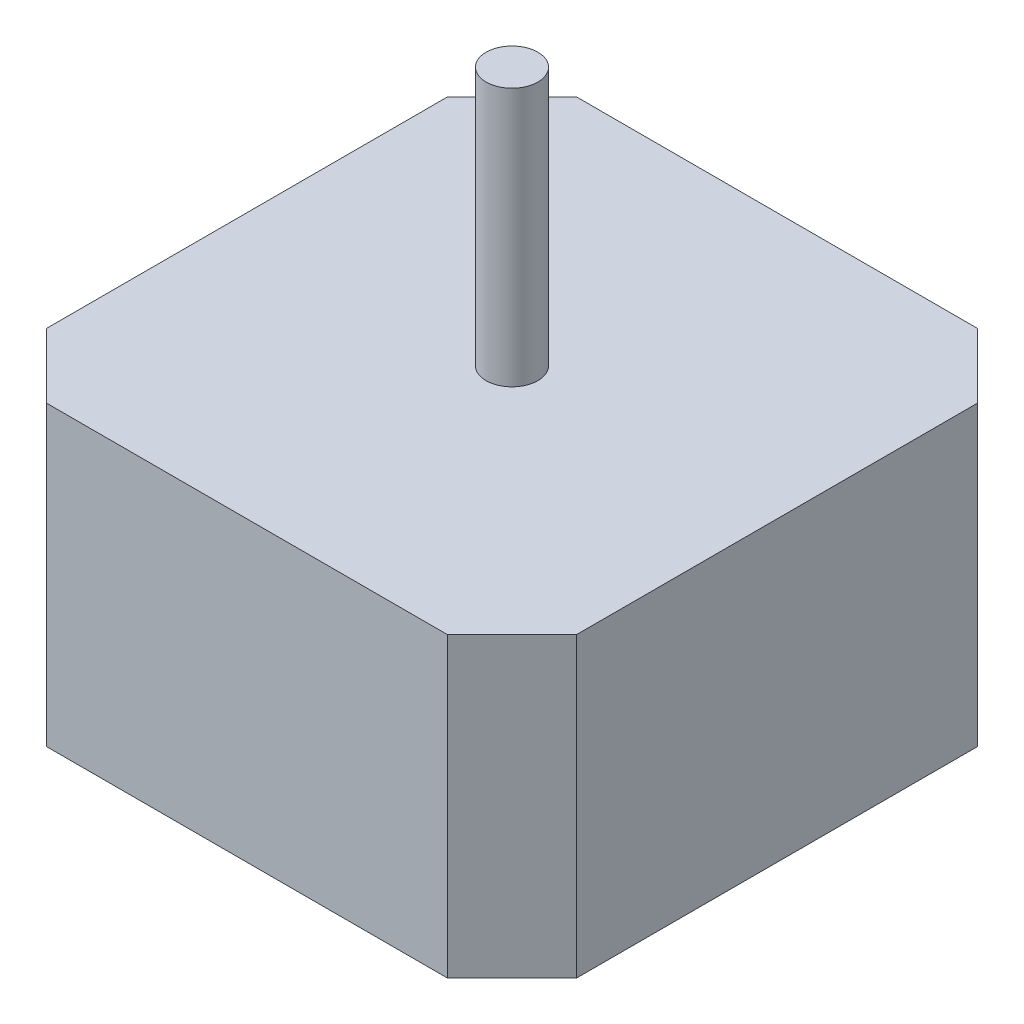
ISO-10303-21;
HEADER;
FILE_DESCRIPTION(('STEP AP214'),'2;1');
FILE_NAME('part.step','',(''),(''),'','','');
FILE_SCHEMA(('AUTOMOTIVE_DESIGN { 1 0 10303 214 1 1 1 1 }'));
ENDSEC;
DATA;
#1=APPLICATION_CONTEXT('core data for automotive mechanical design processes');
#2=APPLICATION_PROTOCOL_DEFINITION('international standard','automotive_design',2000,#1);
#3=PRODUCT_CONTEXT('',#1,'mechanical');
#4=PRODUCT('Part','Part','',(#3));
#5=PRODUCT_RELATED_PRODUCT_CATEGORY('part','',(#4));
#6=PRODUCT_DEFINITION_FORMATION('','',#4);
#7=PRODUCT_DEFINITION_CONTEXT('part definition',#1,'design');
#8=PRODUCT_DEFINITION('design','',#6,#7);
#9=PRODUCT_DEFINITION_SHAPE('','',#8);
#10=(LENGTH_UNIT() NAMED_UNIT(*) SI_UNIT(.MILLI.,.METRE.));
#11=(NAMED_UNIT(*) PLANE_ANGLE_UNIT() SI_UNIT($,.RADIAN.));
#12=(NAMED_UNIT(*) SI_UNIT($,.STERADIAN.) SOLID_ANGLE_UNIT());
#13=UNCERTAINTY_MEASURE_WITH_UNIT(LENGTH_MEASURE(1.E-05),#10,'distance_accuracy_value','');
#14=(GEOMETRIC_REPRESENTATION_CONTEXT(3) GLOBAL_UNCERTAINTY_ASSIGNED_CONTEXT((#13)) GLOBAL_UNIT_ASSIGNED_CONTEXT((#10,
#11,#12)) REPRESENTATION_CONTEXT('',''));
#15=CARTESIAN_POINT('',(0.,0.,0.));
#16=DIRECTION('',(0.,0.,1.));
#17=DIRECTION('',(1.,0.,0.));
#18=AXIS2_PLACEMENT_3D('',#15,#16,#17);
#19=CARTESIAN_POINT('',(7.50925109046818,23.,0.));
#20=DIRECTION('',(-1.,0.,0.));
#21=DIRECTION('',(0.,0.,1.));
#22=AXIS2_PLACEMENT_3D('',#19,#20,#21);
#23=PLANE('',#22);
#24=DIRECTION('',(0.,0.,-1.));
#25=VECTOR('',#24,1.);
#26=CARTESIAN_POINT('',(7.50925109046818,9.,-20.5));
#27=LINE('',#26,#25);
#28=CARTESIAN_POINT('',(7.50925109046818,9.,-20.5));
#29=VERTEX_POINT('',#28);
#30=CARTESIAN_POINT('',(7.50925109046818,9.,-24.5027591201534));
#31=VERTEX_POINT('',#30);
#32=EDGE_CURVE('E145',#29,#31,#27,.T.);
#33=ORIENTED_EDGE('',*,*,#32,.F.);
#34=DIRECTION('',(0.,-1.,0.));
#35=VECTOR('',#34,1.);
#36=CARTESIAN_POINT('',(7.50925109046818,23.,-20.5));
#37=LINE('',#36,#35);
#38=CARTESIAN_POINT('',(7.50925109046818,0.,-20.5));
#39=VERTEX_POINT('',#38);
#40=EDGE_CURVE('E11',#29,#39,#37,.T.);
#41=ORIENTED_EDGE('',*,*,#40,.T.);
#42=DIRECTION('',(0.,0.,-1.));
#43=VECTOR('',#42,1.);
#44=CARTESIAN_POINT('',(7.50925109046818,0.,0.));
#45=LINE('',#44,#43);
#46=CARTESIAN_POINT('',(7.50925109046818,0.,-24.5027591201534));
#47=VERTEX_POINT('',#46);
#48=EDGE_CURVE('E180',#39,#47,#45,.T.);
#49=ORIENTED_EDGE('',*,*,#48,.T.);
#50=DIRECTION('',(0.,-1.,0.));
#51=VECTOR('',#50,1.);
#52=CARTESIAN_POINT('',(7.50925109046818,23.,-24.5027591201534));
#53=LINE('',#52,#51);
#54=EDGE_CURVE('E56',#31,#47,#53,.T.);
#55=ORIENTED_EDGE('',*,*,#54,.F.);
#56=EDGE_LOOP('',(#33,#41,#49,#55));
#57=FACE_BOUND('',#56,.T.);
#58=ADVANCED_FACE('F47',(#57),#23,.F.);
#59=CARTESIAN_POINT('',(0.,23.,-24.5027591201534));
#60=DIRECTION('',(0.,0.,-1.));
#61=DIRECTION('',(-1.,0.,0.));
#62=AXIS2_PLACEMENT_3D('',#59,#60,#61);
#63=PLANE('',#62);
#64=DIRECTION('',(0.,-1.,0.));
#65=VECTOR('',#64,1.);
#66=CARTESIAN_POINT('',(-7.48468716332695,23.,-24.5027591201534));
#67=LINE('',#66,#65);
#68=CARTESIAN_POINT('',(-7.48468716332695,9.,-24.5027591201534));
#69=VERTEX_POINT('',#68);
#70=CARTESIAN_POINT('',(-7.48468716332695,0.,-24.5027591201534));
#71=VERTEX_POINT('',#70);
#72=EDGE_CURVE('E158',#69,#71,#67,.T.);
#73=ORIENTED_EDGE('',*,*,#72,.F.);
#74=DIRECTION('',(-1.,0.,0.));
#75=VECTOR('',#74,1.);
#76=CARTESIAN_POINT('',(7.50925109046818,9.,-24.5027591201534));
#77=LINE('',#76,#75);
#78=EDGE_CURVE('E63',#31,#69,#77,.T.);
#79=ORIENTED_EDGE('',*,*,#78,.F.);
#80=ORIENTED_EDGE('',*,*,#54,.T.);
#81=DIRECTION('',(1.,0.,0.));
#82=VECTOR('',#81,1.);
#83=CARTESIAN_POINT('',(0.,0.,-24.5027591201534));
#84=LINE('',#83,#82);
#85=EDGE_CURVE('E177',#71,#47,#84,.T.);
#86=ORIENTED_EDGE('',*,*,#85,.F.);
#87=EDGE_LOOP('',(#73,#79,#80,#86));
#88=FACE_BOUND('',#87,.T.);
#89=ADVANCED_FACE('F175',(#88),#63,.T.);
#90=CARTESIAN_POINT('',(-7.48468716332695,23.,0.));
#91=DIRECTION('',(-1.,0.,0.));
#92=DIRECTION('',(0.,0.,1.));
#93=AXIS2_PLACEMENT_3D('',#90,#91,#92);
#94=PLANE('',#93);
#95=DIRECTION('',(0.,-1.,0.));
#96=VECTOR('',#95,1.);
#97=CARTESIAN_POINT('',(-7.48468716332695,23.,-20.5));
#98=LINE('',#97,#96);
#99=CARTESIAN_POINT('',(-7.48468716332695,9.,-20.5));
#100=VERTEX_POINT('',#99);
#101=CARTESIAN_POINT('',(-7.48468716332695,0.,-20.5));
#102=VERTEX_POINT('',#101);
#103=EDGE_CURVE('E140',#100,#102,#98,.T.);
#104=ORIENTED_EDGE('',*,*,#103,.F.);
#105=DIRECTION('',(0.,0.,1.));
#106=VECTOR('',#105,1.);
#107=CARTESIAN_POINT('',(-7.48468716332695,9.,-24.5027591201534));
#108=LINE('',#107,#106);
#109=EDGE_CURVE('E146',#69,#100,#108,.T.);
#110=ORIENTED_EDGE('',*,*,#109,.F.);
#111=ORIENTED_EDGE('',*,*,#72,.T.);
#112=DIRECTION('',(0.,0.,-1.));
#113=VECTOR('',#112,1.);
#114=CARTESIAN_POINT('',(-7.48468716332695,0.,0.));
#115=LINE('',#114,#113);
#116=EDGE_CURVE('E156',#102,#71,#115,.T.);
#117=ORIENTED_EDGE('',*,*,#116,.F.);
#118=EDGE_LOOP('',(#104,#110,#111,#117));
#119=FACE_BOUND('',#118,.T.);
#120=ADVANCED_FACE('F154',(#119),#94,.T.);
#121=CARTESIAN_POINT('',(0.,23.,0.));
#122=DIRECTION('',(0.,1.,0.));
#123=DIRECTION('',(0.,0.,1.));
#124=AXIS2_PLACEMENT_3D('',#121,#122,#123);
#125=PLANE('',#124);
#126=CARTESIAN_POINT('',(0.,23.,0.));
#127=DIRECTION('',(0.,1.,0.));
#128=DIRECTION('',(0.,0.,1.));
#129=AXIS2_PLACEMENT_3D('',#126,#127,#128);
#130=CIRCLE('',#129,2.);
#131=CARTESIAN_POINT('',(0.,23.,2.));
#132=VERTEX_POINT('',#131);
#133=EDGE_CURVE('E280',#132,#132,#130,.T.);
#134=ORIENTED_EDGE('',*,*,#133,.F.);
#135=EDGE_LOOP('',(#134));
#136=FACE_BOUND('',#135,.T.);
#137=DIRECTION('',(1.,0.,0.));
#138=VECTOR('',#137,1.);
#139=CARTESIAN_POINT('',(0.,23.,-20.5));
#140=LINE('',#139,#138);
#141=CARTESIAN_POINT('',(-15.5,23.,-20.5));
#142=VERTEX_POINT('',#141);
#143=CARTESIAN_POINT('',(15.5,23.,-20.5));
#144=VERTEX_POINT('',#143);
#145=EDGE_CURVE('E221',#142,#144,#140,.T.);
#146=ORIENTED_EDGE('',*,*,#145,.F.);
#147=DIRECTION('',(0.707106781186548,0.,-0.707106781186548));
#148=VECTOR('',#147,1.);
#149=CARTESIAN_POINT('',(-20.5,23.,-15.5));
#150=LINE('',#149,#148);
#151=CARTESIAN_POINT('',(-20.5,23.,-15.5));
#152=VERTEX_POINT('',#151);
#153=EDGE_CURVE('E230',#152,#142,#150,.T.);
#154=ORIENTED_EDGE('',*,*,#153,.F.);
#155=DIRECTION('',(0.,0.,1.));
#156=VECTOR('',#155,1.);
#157=CARTESIAN_POINT('',(-20.5,23.,0.));
#158=LINE('',#157,#156);
#159=CARTESIAN_POINT('',(-20.5,23.,15.5));
#160=VERTEX_POINT('',#159);
#161=EDGE_CURVE('E165',#152,#160,#158,.T.);
#162=ORIENTED_EDGE('',*,*,#161,.T.);
#163=DIRECTION('',(0.707106781186548,0.,0.707106781186548));
#164=VECTOR('',#163,1.);
#165=CARTESIAN_POINT('',(-20.5,23.,15.5));
#166=LINE('',#165,#164);
#167=CARTESIAN_POINT('',(-15.5,23.,20.5));
#168=VERTEX_POINT('',#167);
#169=EDGE_CURVE('E266',#160,#168,#166,.T.);
#170=ORIENTED_EDGE('',*,*,#169,.T.);
#171=DIRECTION('',(1.,0.,0.));
#172=VECTOR('',#171,1.);
#173=CARTESIAN_POINT('',(0.,23.,20.5));
#174=LINE('',#173,#172);
#175=CARTESIAN_POINT('',(15.5,23.,20.5));
#176=VERTEX_POINT('',#175);
#177=EDGE_CURVE('E159',#168,#176,#174,.T.);
#178=ORIENTED_EDGE('',*,*,#177,.T.);
#179=DIRECTION('',(-0.707106781186547,0.,0.707106781186548));
#180=VECTOR('',#179,1.);
#181=CARTESIAN_POINT('',(20.5,23.,15.5));
#182=LINE('',#181,#180);
#183=CARTESIAN_POINT('',(20.5,23.,15.5));
#184=VERTEX_POINT('',#183);
#185=EDGE_CURVE('E250',#184,#176,#182,.T.);
#186=ORIENTED_EDGE('',*,*,#185,.F.);
#187=DIRECTION('',(0.,0.,1.));
#188=VECTOR('',#187,1.);
#189=CARTESIAN_POINT('',(20.5,23.,0.));
#190=LINE('',#189,#188);
#191=CARTESIAN_POINT('',(20.5,23.,-15.5));
#192=VERTEX_POINT('',#191);
#193=EDGE_CURVE('E204',#192,#184,#190,.T.);
#194=ORIENTED_EDGE('',*,*,#193,.F.);
#195=DIRECTION('',(0.707106781186548,0.,0.707106781186548));
#196=VECTOR('',#195,1.);
#197=CARTESIAN_POINT('',(15.5,23.,-20.5));
#198=LINE('',#197,#196);
#199=EDGE_CURVE('E238',#144,#192,#198,.T.);
#200=ORIENTED_EDGE('',*,*,#199,.F.);
#201=EDGE_LOOP('',(#146,#154,#162,#170,#178,#186,#194,#200));
#202=FACE_BOUND('',#201,.T.);
#203=ADVANCED_FACE('F296',(#136,#202),#125,.T.);
#204=CARTESIAN_POINT('',(0.,0.,0.));
#205=DIRECTION('',(0.,1.,0.));
#206=DIRECTION('',(0.,0.,1.));
#207=AXIS2_PLACEMENT_3D('',#204,#205,#206);
#208=PLANE('',#207);
#209=DIRECTION('',(1.,0.,0.));
#210=VECTOR('',#209,1.);
#211=CARTESIAN_POINT('',(0.,0.,20.5));
#212=LINE('',#211,#210);
#213=CARTESIAN_POINT('',(-15.5,0.,20.5));
#214=VERTEX_POINT('',#213);
#215=CARTESIAN_POINT('',(15.5,0.,20.5));
#216=VERTEX_POINT('',#215);
#217=EDGE_CURVE('E168',#214,#216,#212,.T.);
#218=ORIENTED_EDGE('',*,*,#217,.F.);
#219=DIRECTION('',(0.707106781186548,0.,0.707106781186548));
#220=VECTOR('',#219,1.);
#221=CARTESIAN_POINT('',(-20.5,0.,15.5));
#222=LINE('',#221,#220);
#223=CARTESIAN_POINT('',(-20.5,0.,15.5));
#224=VERTEX_POINT('',#223);
#225=EDGE_CURVE('E257',#224,#214,#222,.T.);
#226=ORIENTED_EDGE('',*,*,#225,.F.);
#227=DIRECTION('',(0.,0.,1.));
#228=VECTOR('',#227,1.);
#229=CARTESIAN_POINT('',(-20.5,0.,0.));
#230=LINE('',#229,#228);
#231=CARTESIAN_POINT('',(-20.5,0.,-15.5));
#232=VERTEX_POINT('',#231);
#233=EDGE_CURVE('E194',#232,#224,#230,.T.);
#234=ORIENTED_EDGE('',*,*,#233,.F.);
#235=DIRECTION('',(0.707106781186548,0.,-0.707106781186548));
#236=VECTOR('',#235,1.);
#237=CARTESIAN_POINT('',(-20.5,0.,-15.5));
#238=LINE('',#237,#236);
#239=CARTESIAN_POINT('',(-15.5,0.,-20.5));
#240=VERTEX_POINT('',#239);
#241=EDGE_CURVE('E231',#232,#240,#238,.T.);
#242=ORIENTED_EDGE('',*,*,#241,.T.);
#243=DIRECTION('',(1.,0.,0.));
#244=VECTOR('',#243,1.);
#245=CARTESIAN_POINT('',(0.,0.,-20.5));
#246=LINE('',#245,#244);
#247=EDGE_CURVE('E191',#240,#102,#246,.T.);
#248=ORIENTED_EDGE('',*,*,#247,.T.);
#249=ORIENTED_EDGE('',*,*,#116,.T.);
#250=ORIENTED_EDGE('',*,*,#85,.T.);
#251=ORIENTED_EDGE('',*,*,#48,.F.);
#252=CARTESIAN_POINT('',(15.5,0.,-20.5));
#253=VERTEX_POINT('',#252);
#254=EDGE_CURVE('E184',#39,#253,#246,.T.);
#255=ORIENTED_EDGE('',*,*,#254,.T.);
#256=DIRECTION('',(0.707106781186548,0.,0.707106781186548));
#257=VECTOR('',#256,1.);
#258=CARTESIAN_POINT('',(15.5,0.,-20.5));
#259=LINE('',#258,#257);
#260=CARTESIAN_POINT('',(20.5,0.,-15.5));
#261=VERTEX_POINT('',#260);
#262=EDGE_CURVE('E71',#253,#261,#259,.T.);
#263=ORIENTED_EDGE('',*,*,#262,.T.);
#264=DIRECTION('',(0.,0.,1.));
#265=VECTOR('',#264,1.);
#266=CARTESIAN_POINT('',(20.5,0.,0.));
#267=LINE('',#266,#265);
#268=CARTESIAN_POINT('',(20.5,0.,15.5));
#269=VERTEX_POINT('',#268);
#270=EDGE_CURVE('E208',#261,#269,#267,.T.);
#271=ORIENTED_EDGE('',*,*,#270,.T.);
#272=DIRECTION('',(-0.707106781186547,0.,0.707106781186548));
#273=VECTOR('',#272,1.);
#274=CARTESIAN_POINT('',(20.5,0.,15.5));
#275=LINE('',#274,#273);
#276=EDGE_CURVE('E253',#269,#216,#275,.T.);
#277=ORIENTED_EDGE('',*,*,#276,.T.);
#278=EDGE_LOOP('',(#218,#226,#234,#242,#248,#249,#250,#251,#255,#263,#271,#277));
#279=FACE_BOUND('',#278,.T.);
#280=ADVANCED_FACE('F187',(#279),#208,.F.);
#281=CARTESIAN_POINT('',(20.5,23.,0.));
#282=DIRECTION('',(1.,0.,0.));
#283=DIRECTION('',(0.,0.,-1.));
#284=AXIS2_PLACEMENT_3D('',#281,#282,#283);
#285=PLANE('',#284);
#286=ORIENTED_EDGE('',*,*,#193,.T.);
#287=DIRECTION('',(0.,-1.,0.));
#288=VECTOR('',#287,1.);
#289=CARTESIAN_POINT('',(20.5,23.,15.5));
#290=LINE('',#289,#288);
#291=EDGE_CURVE('E244',#184,#269,#290,.T.);
#292=ORIENTED_EDGE('',*,*,#291,.T.);
#293=ORIENTED_EDGE('',*,*,#270,.F.);
#294=DIRECTION('',(0.,-1.,0.));
#295=VECTOR('',#294,1.);
#296=CARTESIAN_POINT('',(20.5,23.,-15.5));
#297=LINE('',#296,#295);
#298=EDGE_CURVE('E241',#192,#261,#297,.T.);
#299=ORIENTED_EDGE('',*,*,#298,.F.);
#300=EDGE_LOOP('',(#286,#292,#293,#299));
#301=FACE_BOUND('',#300,.T.);
#302=ADVANCED_FACE('F49',(#301),#285,.T.);
#303=CARTESIAN_POINT('',(0.,23.,20.5));
#304=DIRECTION('',(0.,0.,-1.));
#305=DIRECTION('',(-1.,0.,0.));
#306=AXIS2_PLACEMENT_3D('',#303,#304,#305);
#307=PLANE('',#306);
#308=ORIENTED_EDGE('',*,*,#177,.F.);
#309=DIRECTION('',(0.,-1.,0.));
#310=VECTOR('',#309,1.);
#311=CARTESIAN_POINT('',(-15.5,23.,20.5));
#312=LINE('',#311,#310);
#313=EDGE_CURVE('E234',#168,#214,#312,.T.);
#314=ORIENTED_EDGE('',*,*,#313,.T.);
#315=ORIENTED_EDGE('',*,*,#217,.T.);
#316=DIRECTION('',(0.,-1.,0.));
#317=VECTOR('',#316,1.);
#318=CARTESIAN_POINT('',(15.5,23.,20.5));
#319=LINE('',#318,#317);
#320=EDGE_CURVE('E254',#176,#216,#319,.T.);
#321=ORIENTED_EDGE('',*,*,#320,.F.);
#322=EDGE_LOOP('',(#308,#314,#315,#321));
#323=FACE_BOUND('',#322,.T.);
#324=ADVANCED_FACE('F313',(#323),#307,.F.);
#325=CARTESIAN_POINT('',(0.,23.,-20.5));
#326=DIRECTION('',(0.,0.,-1.));
#327=DIRECTION('',(-1.,0.,0.));
#328=AXIS2_PLACEMENT_3D('',#325,#326,#327);
#329=PLANE('',#328);
#330=ORIENTED_EDGE('',*,*,#247,.F.);
#331=DIRECTION('',(0.,-1.,0.));
#332=VECTOR('',#331,1.);
#333=CARTESIAN_POINT('',(-15.5,23.,-20.5));
#334=LINE('',#333,#332);
#335=EDGE_CURVE('E215',#142,#240,#334,.T.);
#336=ORIENTED_EDGE('',*,*,#335,.F.);
#337=ORIENTED_EDGE('',*,*,#145,.T.);
#338=DIRECTION('',(0.,-1.,0.));
#339=VECTOR('',#338,1.);
#340=CARTESIAN_POINT('',(15.5,23.,-20.5));
#341=LINE('',#340,#339);
#342=EDGE_CURVE('E247',#144,#253,#341,.T.);
#343=ORIENTED_EDGE('',*,*,#342,.T.);
#344=ORIENTED_EDGE('',*,*,#254,.F.);
#345=ORIENTED_EDGE('',*,*,#40,.F.);
#346=DIRECTION('',(1.,0.,0.));
#347=VECTOR('',#346,1.);
#348=CARTESIAN_POINT('',(-7.48468716332695,9.,-20.5));
#349=LINE('',#348,#347);
#350=EDGE_CURVE('E136',#100,#29,#349,.T.);
#351=ORIENTED_EDGE('',*,*,#350,.F.);
#352=ORIENTED_EDGE('',*,*,#103,.T.);
#353=EDGE_LOOP('',(#330,#336,#337,#343,#344,#345,#351,#352));
#354=FACE_BOUND('',#353,.T.);
#355=ADVANCED_FACE('F138',(#354),#329,.T.);
#356=CARTESIAN_POINT('',(-20.5,23.,0.));
#357=DIRECTION('',(1.,0.,0.));
#358=DIRECTION('',(0.,0.,-1.));
#359=AXIS2_PLACEMENT_3D('',#356,#357,#358);
#360=PLANE('',#359);
#361=ORIENTED_EDGE('',*,*,#233,.T.);
#362=DIRECTION('',(0.,-1.,0.));
#363=VECTOR('',#362,1.);
#364=CARTESIAN_POINT('',(-20.5,23.,15.5));
#365=LINE('',#364,#363);
#366=EDGE_CURVE('E263',#160,#224,#365,.T.);
#367=ORIENTED_EDGE('',*,*,#366,.F.);
#368=ORIENTED_EDGE('',*,*,#161,.F.);
#369=DIRECTION('',(0.,-1.,0.));
#370=VECTOR('',#369,1.);
#371=CARTESIAN_POINT('',(-20.5,23.,-15.5));
#372=LINE('',#371,#370);
#373=EDGE_CURVE('E211',#152,#232,#372,.T.);
#374=ORIENTED_EDGE('',*,*,#373,.T.);
#375=EDGE_LOOP('',(#361,#367,#368,#374));
#376=FACE_BOUND('',#375,.T.);
#377=ADVANCED_FACE('F307',(#376),#360,.F.);
#378=CARTESIAN_POINT('',(-20.5,23.,-15.5));
#379=DIRECTION('',(-0.707106781186547,0.,-0.707106781186547));
#380=DIRECTION('',(-0.707106781186548,0.,0.707106781186548));
#381=AXIS2_PLACEMENT_3D('',#378,#379,#380);
#382=PLANE('',#381);
#383=ORIENTED_EDGE('',*,*,#241,.F.);
#384=ORIENTED_EDGE('',*,*,#373,.F.);
#385=ORIENTED_EDGE('',*,*,#153,.T.);
#386=ORIENTED_EDGE('',*,*,#335,.T.);
#387=EDGE_LOOP('',(#383,#384,#385,#386));
#388=FACE_BOUND('',#387,.T.);
#389=ADVANCED_FACE('F306',(#388),#382,.T.);
#390=CARTESIAN_POINT('',(20.5,23.,15.5));
#391=DIRECTION('',(0.707106781186548,0.,0.707106781186547));
#392=DIRECTION('',(0.707106781186547,0.,-0.707106781186548));
#393=AXIS2_PLACEMENT_3D('',#390,#391,#392);
#394=PLANE('',#393);
#395=ORIENTED_EDGE('',*,*,#276,.F.);
#396=ORIENTED_EDGE('',*,*,#291,.F.);
#397=ORIENTED_EDGE('',*,*,#185,.T.);
#398=ORIENTED_EDGE('',*,*,#320,.T.);
#399=EDGE_LOOP('',(#395,#396,#397,#398));
#400=FACE_BOUND('',#399,.T.);
#401=ADVANCED_FACE('F328',(#400),#394,.T.);
#402=CARTESIAN_POINT('',(-20.5,23.,15.5));
#403=DIRECTION('',(0.707106781186547,0.,-0.707106781186547));
#404=DIRECTION('',(-0.707106781186548,0.,-0.707106781186548));
#405=AXIS2_PLACEMENT_3D('',#402,#403,#404);
#406=PLANE('',#405);
#407=ORIENTED_EDGE('',*,*,#225,.T.);
#408=ORIENTED_EDGE('',*,*,#313,.F.);
#409=ORIENTED_EDGE('',*,*,#169,.F.);
#410=ORIENTED_EDGE('',*,*,#366,.T.);
#411=EDGE_LOOP('',(#407,#408,#409,#410));
#412=FACE_BOUND('',#411,.T.);
#413=ADVANCED_FACE('F310',(#412),#406,.F.);
#414=CARTESIAN_POINT('',(15.5,23.,-20.5));
#415=DIRECTION('',(0.707106781186547,0.,-0.707106781186547));
#416=DIRECTION('',(-0.707106781186548,0.,-0.707106781186548));
#417=AXIS2_PLACEMENT_3D('',#414,#415,#416);
#418=PLANE('',#417);
#419=ORIENTED_EDGE('',*,*,#262,.F.);
#420=ORIENTED_EDGE('',*,*,#342,.F.);
#421=ORIENTED_EDGE('',*,*,#199,.T.);
#422=ORIENTED_EDGE('',*,*,#298,.T.);
#423=EDGE_LOOP('',(#419,#420,#421,#422));
#424=FACE_BOUND('',#423,.T.);
#425=ADVANCED_FACE('F319',(#424),#418,.T.);
#426=CARTESIAN_POINT('',(0.,9.,0.));
#427=DIRECTION('',(0.,1.,0.));
#428=DIRECTION('',(0.,0.,1.));
#429=AXIS2_PLACEMENT_3D('',#426,#427,#428);
#430=PLANE('',#429);
#431=ORIENTED_EDGE('',*,*,#78,.T.);
#432=ORIENTED_EDGE('',*,*,#109,.T.);
#433=ORIENTED_EDGE('',*,*,#350,.T.);
#434=ORIENTED_EDGE('',*,*,#32,.T.);
#435=EDGE_LOOP('',(#431,#432,#433,#434));
#436=FACE_BOUND('',#435,.T.);
#437=ADVANCED_FACE('F148',(#436),#430,.T.);
#438=CARTESIAN_POINT('',(0.,43.,0.));
#439=DIRECTION('',(0.,-1.,0.));
#440=DIRECTION('',(0.,0.,-1.));
#441=AXIS2_PLACEMENT_3D('',#438,#439,#440);
#442=CYLINDRICAL_SURFACE('',#441,2.);
#443=CARTESIAN_POINT('',(0.,43.,0.));
#444=DIRECTION('',(0.,1.,0.));
#445=DIRECTION('',(0.,0.,1.));
#446=AXIS2_PLACEMENT_3D('',#443,#444,#445);
#447=CIRCLE('',#446,2.);
#448=CARTESIAN_POINT('',(0.,43.,2.));
#449=VERTEX_POINT('',#448);
#450=EDGE_CURVE('E279',#449,#449,#447,.T.);
#451=ORIENTED_EDGE('',*,*,#450,.F.);
#452=EDGE_LOOP('',(#451));
#453=FACE_BOUND('',#452,.T.);
#454=ORIENTED_EDGE('',*,*,#133,.T.);
#455=EDGE_LOOP('',(#454));
#456=FACE_BOUND('',#455,.T.);
#457=ADVANCED_FACE('F290',(#453,#456),#442,.T.);
#458=CARTESIAN_POINT('',(0.,43.,0.));
#459=DIRECTION('',(0.,1.,0.));
#460=DIRECTION('',(0.,0.,1.));
#461=AXIS2_PLACEMENT_3D('',#458,#459,#460);
#462=PLANE('',#461);
#463=ORIENTED_EDGE('',*,*,#450,.T.);
#464=EDGE_LOOP('',(#463));
#465=FACE_BOUND('',#464,.T.);
#466=ADVANCED_FACE('F288',(#465),#462,.T.);
#467=CLOSED_SHELL('',(#58,#89,#120,#203,#280,#302,#324,#355,#377,#389,#401,#413,#425,#437,#457,#466));
#468=MANIFOLD_SOLID_BREP('B2',#467);
#469=ADVANCED_BREP_SHAPE_REPRESENTATION('',(#18,#468),#14);
#470=SHAPE_DEFINITION_REPRESENTATION(#9,#469);
ENDSEC;
END-ISO-10303-21;
